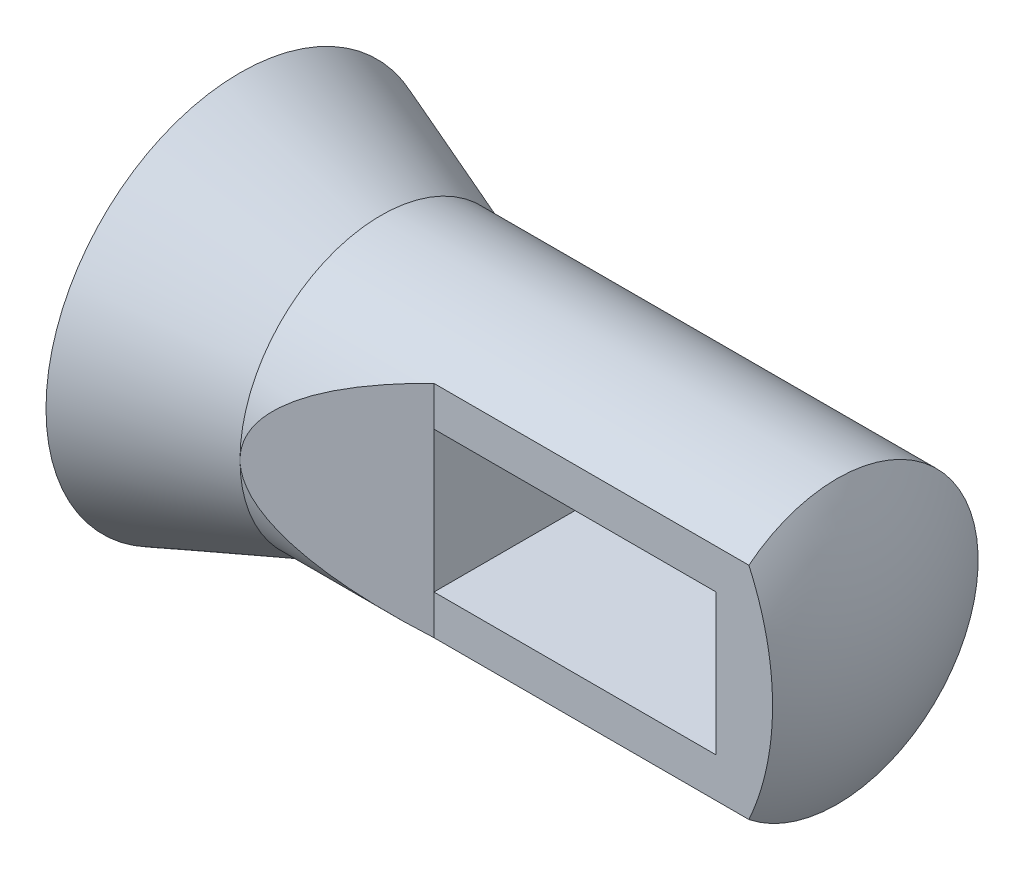
ISO-10303-21;
HEADER;
FILE_DESCRIPTION(('STEP AP214'),'2;1');
FILE_NAME('part.step','',(''),(''),'','','');
FILE_SCHEMA(('AUTOMOTIVE_DESIGN { 1 0 10303 214 1 1 1 1 }'));
ENDSEC;
DATA;
#1=APPLICATION_CONTEXT('core data for automotive mechanical design processes');
#2=APPLICATION_PROTOCOL_DEFINITION('international standard','automotive_design',2000,#1);
#3=PRODUCT_CONTEXT('',#1,'mechanical');
#4=PRODUCT('Part','Part','',(#3));
#5=PRODUCT_RELATED_PRODUCT_CATEGORY('part','',(#4));
#6=PRODUCT_DEFINITION_FORMATION('','',#4);
#7=PRODUCT_DEFINITION_CONTEXT('part definition',#1,'design');
#8=PRODUCT_DEFINITION('design','',#6,#7);
#9=PRODUCT_DEFINITION_SHAPE('','',#8);
#10=(LENGTH_UNIT() NAMED_UNIT(*) SI_UNIT(.MILLI.,.METRE.));
#11=(NAMED_UNIT(*) PLANE_ANGLE_UNIT() SI_UNIT($,.RADIAN.));
#12=(NAMED_UNIT(*) SI_UNIT($,.STERADIAN.) SOLID_ANGLE_UNIT());
#13=UNCERTAINTY_MEASURE_WITH_UNIT(LENGTH_MEASURE(1.E-05),#10,'distance_accuracy_value','');
#14=(GEOMETRIC_REPRESENTATION_CONTEXT(3) GLOBAL_UNCERTAINTY_ASSIGNED_CONTEXT((#13)) GLOBAL_UNIT_ASSIGNED_CONTEXT((#10,
#11,#12)) REPRESENTATION_CONTEXT('',''));
#15=CARTESIAN_POINT('',(0.,0.,0.));
#16=DIRECTION('',(0.,0.,1.));
#17=DIRECTION('',(1.,0.,0.));
#18=AXIS2_PLACEMENT_3D('',#15,#16,#17);
#19=CARTESIAN_POINT('',(0.,0.,0.));
#20=DIRECTION('',(1.,0.,0.));
#21=DIRECTION('',(0.,1.,0.));
#22=AXIS2_PLACEMENT_3D('',#19,#20,#21);
#23=PLANE('',#22);
#24=CARTESIAN_POINT('',(0.,0.,0.));
#25=DIRECTION('',(-1.,0.,0.));
#26=DIRECTION('',(0.,-1.,0.));
#27=AXIS2_PLACEMENT_3D('',#24,#25,#26);
#28=CIRCLE('',#27,34.925);
#29=CARTESIAN_POINT('',(0.,-34.925,0.));
#30=VERTEX_POINT('',#29);
#31=EDGE_CURVE('E142',#30,#30,#28,.T.);
#32=ORIENTED_EDGE('',*,*,#31,.T.);
#33=EDGE_LOOP('',(#32));
#34=FACE_BOUND('',#33,.T.);
#35=ADVANCED_FACE('F33',(#34),#23,.F.);
#36=CARTESIAN_POINT('',(25.4,0.,0.));
#37=DIRECTION('',(-1.,0.,0.));
#38=DIRECTION('',(0.,-1.,0.));
#39=AXIS2_PLACEMENT_3D('',#36,#37,#38);
#40=CONICAL_SURFACE('',#39,25.4,0.358770670270572);
#41=ORIENTED_EDGE('',*,*,#31,.F.);
#42=EDGE_LOOP('',(#41));
#43=FACE_BOUND('',#42,.T.);
#44=CARTESIAN_POINT('',(25.4,0.,0.));
#45=DIRECTION('',(-1.,0.,0.));
#46=DIRECTION('',(0.,-1.,0.));
#47=AXIS2_PLACEMENT_3D('',#44,#45,#46);
#48=CIRCLE('',#47,25.4);
#49=CARTESIAN_POINT('',(25.4,0.,25.4));
#50=VERTEX_POINT('',#49);
#51=EDGE_CURVE('E139',#50,#50,#48,.T.);
#52=ORIENTED_EDGE('',*,*,#51,.T.);
#53=EDGE_LOOP('',(#52));
#54=FACE_BOUND('',#53,.T.);
#55=ADVANCED_FACE('F156',(#43,#54),#40,.T.);
#56=CARTESIAN_POINT('',(0.,0.,0.));
#57=DIRECTION('',(-1.,0.,0.));
#58=DIRECTION('',(0.,-1.,0.));
#59=AXIS2_PLACEMENT_3D('',#56,#57,#58);
#60=CYLINDRICAL_SURFACE('',#59,25.4);
#61=DIRECTION('',(-1.,0.,0.));
#62=VECTOR('',#61,1.);
#63=CARTESIAN_POINT('',(0.,12.7,-21.9970452561248));
#64=LINE('',#63,#62);
#65=CARTESIAN_POINT('',(101.6,12.7,-21.9970452561247));
#66=VERTEX_POINT('',#65);
#67=CARTESIAN_POINT('',(50.8,12.7,-21.9970452561248));
#68=VERTEX_POINT('',#67);
#69=EDGE_CURVE('E121',#66,#68,#64,.T.);
#70=ORIENTED_EDGE('',*,*,#69,.T.);
#71=CARTESIAN_POINT('',(50.8,0.,0.));
#72=DIRECTION('',(-1.,0.,0.));
#73=DIRECTION('',(0.,0.,1.));
#74=AXIS2_PLACEMENT_3D('',#71,#72,#73);
#75=CIRCLE('',#74,25.4);
#76=CARTESIAN_POINT('',(50.8,-12.7,-21.9970452561247));
#77=VERTEX_POINT('',#76);
#78=EDGE_CURVE('E124',#68,#77,#75,.T.);
#79=ORIENTED_EDGE('',*,*,#78,.T.);
#80=DIRECTION('',(-1.,0.,0.));
#81=VECTOR('',#80,1.);
#82=CARTESIAN_POINT('',(0.,-12.7,-21.9970452561247));
#83=LINE('',#82,#81);
#84=CARTESIAN_POINT('',(101.6,-12.7,-21.9970452561247));
#85=VERTEX_POINT('',#84);
#86=EDGE_CURVE('E116',#77,#85,#83,.F.);
#87=ORIENTED_EDGE('',*,*,#86,.T.);
#88=CARTESIAN_POINT('',(101.6,0.,0.));
#89=DIRECTION('',(1.,0.,0.));
#90=DIRECTION('',(0.,0.,-1.));
#91=AXIS2_PLACEMENT_3D('',#88,#89,#90);
#92=CIRCLE('',#91,25.4);
#93=EDGE_CURVE('E94',#85,#66,#92,.T.);
#94=ORIENTED_EDGE('',*,*,#93,.T.);
#95=EDGE_LOOP('',(#70,#79,#87,#94));
#96=FACE_BOUND('',#95,.T.);
#97=DIRECTION('',(-1.,0.,0.));
#98=VECTOR('',#97,1.);
#99=CARTESIAN_POINT('',(0.,-19.8278686449149,15.875));
#100=LINE('',#99,#98);
#101=CARTESIAN_POINT('',(107.494090512249,-19.8278686449149,15.875));
#102=VERTEX_POINT('',#101);
#103=CARTESIAN_POINT('',(50.8,-19.8278686449149,15.875));
#104=VERTEX_POINT('',#103);
#105=EDGE_CURVE('E133',#102,#104,#100,.T.);
#106=ORIENTED_EDGE('',*,*,#105,.T.);
#107=CARTESIAN_POINT('',(93.1333333333333,0.,0.));
#108=DIRECTION('',(-0.351123441588392,0.,-0.936329177569045));
#109=DIRECTION('',(-0.936329177569045,0.,0.351123441588392));
#110=AXIS2_PLACEMENT_3D('',#107,#108,#109);
#111=ELLIPSE('',#110,72.3392317103551,25.4);
#112=EDGE_CURVE('E11',#104,#50,#111,.T.);
#113=ORIENTED_EDGE('',*,*,#112,.T.);
#114=ORIENTED_EDGE('',*,*,#51,.F.);
#115=CARTESIAN_POINT('',(50.8,19.8278686449149,15.875));
#116=VERTEX_POINT('',#115);
#117=EDGE_CURVE('E36',#50,#116,#111,.T.);
#118=ORIENTED_EDGE('',*,*,#117,.T.);
#119=DIRECTION('',(-1.,0.,0.));
#120=VECTOR('',#119,1.);
#121=CARTESIAN_POINT('',(0.,19.8278686449149,15.875));
#122=LINE('',#121,#120);
#123=CARTESIAN_POINT('',(107.494090512249,19.8278686449149,15.875));
#124=VERTEX_POINT('',#123);
#125=EDGE_CURVE('E130',#116,#124,#122,.F.);
#126=ORIENTED_EDGE('',*,*,#125,.T.);
#127=CARTESIAN_POINT('',(107.494090512249,0.,0.));
#128=DIRECTION('',(-1.,0.,0.));
#129=DIRECTION('',(0.,-1.,0.));
#130=AXIS2_PLACEMENT_3D('',#127,#128,#129);
#131=CIRCLE('',#130,25.4);
#132=EDGE_CURVE('E136',#124,#102,#131,.T.);
#133=ORIENTED_EDGE('',*,*,#132,.T.);
#134=EDGE_LOOP('',(#106,#113,#114,#118,#126,#133));
#135=FACE_BOUND('',#134,.T.);
#136=ADVANCED_FACE('F151',(#96,#135),#60,.T.);
#137=CARTESIAN_POINT('',(63.5,0.,0.));
#138=DIRECTION('',(-1.,0.,0.));
#139=DIRECTION('',(0.,1.,0.));
#140=AXIS2_PLACEMENT_3D('',#137,#138,#139);
#141=SPHERICAL_SURFACE('',#140,50.8);
#142=ORIENTED_EDGE('',*,*,#132,.F.);
#143=CARTESIAN_POINT('',(63.5,0.,15.875));
#144=DIRECTION('',(0.,0.,-1.));
#145=DIRECTION('',(-1.,0.,0.));
#146=AXIS2_PLACEMENT_3D('',#143,#144,#145);
#147=CIRCLE('',#146,48.2558221875869);
#148=EDGE_CURVE('E144',#124,#102,#147,.T.);
#149=ORIENTED_EDGE('',*,*,#148,.T.);
#150=EDGE_LOOP('',(#142,#149));
#151=FACE_BOUND('',#150,.T.);
#152=ADVANCED_FACE('F163',(#151),#141,.T.);
#153=CARTESIAN_POINT('',(25.4,-34.925,25.4));
#154=DIRECTION('',(-0.351123441588392,0.,-0.936329177569045));
#155=DIRECTION('',(-0.936329177569045,0.,0.351123441588392));
#156=AXIS2_PLACEMENT_3D('',#153,#154,#155);
#157=PLANE('',#156);
#158=ORIENTED_EDGE('',*,*,#112,.F.);
#159=DIRECTION('',(0.,1.,0.));
#160=VECTOR('',#159,1.);
#161=CARTESIAN_POINT('',(50.8,-34.925,15.875));
#162=LINE('',#161,#160);
#163=CARTESIAN_POINT('',(50.8,-12.7,15.875));
#164=VERTEX_POINT('',#163);
#165=EDGE_CURVE('E128',#104,#164,#162,.T.);
#166=ORIENTED_EDGE('',*,*,#165,.T.);
#167=DIRECTION('',(0.,-1.,0.));
#168=VECTOR('',#167,1.);
#169=CARTESIAN_POINT('',(50.8,12.7,15.875));
#170=LINE('',#169,#168);
#171=CARTESIAN_POINT('',(50.8,12.7,15.875));
#172=VERTEX_POINT('',#171);
#173=EDGE_CURVE('E55',#172,#164,#170,.T.);
#174=ORIENTED_EDGE('',*,*,#173,.F.);
#175=EDGE_CURVE('E127',#172,#116,#162,.T.);
#176=ORIENTED_EDGE('',*,*,#175,.T.);
#177=ORIENTED_EDGE('',*,*,#117,.F.);
#178=EDGE_LOOP('',(#158,#166,#174,#176,#177));
#179=FACE_BOUND('',#178,.T.);
#180=ADVANCED_FACE('F154',(#179),#157,.F.);
#181=CARTESIAN_POINT('',(50.8,-34.925,15.875));
#182=DIRECTION('',(0.,0.,-1.));
#183=DIRECTION('',(-1.,0.,0.));
#184=AXIS2_PLACEMENT_3D('',#181,#182,#183);
#185=PLANE('',#184);
#186=ORIENTED_EDGE('',*,*,#175,.F.);
#187=DIRECTION('',(-1.,0.,0.));
#188=VECTOR('',#187,1.);
#189=CARTESIAN_POINT('',(50.8,12.7,15.875));
#190=LINE('',#189,#188);
#191=CARTESIAN_POINT('',(101.6,12.7,15.875));
#192=VERTEX_POINT('',#191);
#193=EDGE_CURVE('E109',#192,#172,#190,.T.);
#194=ORIENTED_EDGE('',*,*,#193,.F.);
#195=DIRECTION('',(0.,1.,0.));
#196=VECTOR('',#195,1.);
#197=CARTESIAN_POINT('',(101.6,-12.7,15.875));
#198=LINE('',#197,#196);
#199=CARTESIAN_POINT('',(101.6,-12.7,15.875));
#200=VERTEX_POINT('',#199);
#201=EDGE_CURVE('E91',#200,#192,#198,.T.);
#202=ORIENTED_EDGE('',*,*,#201,.F.);
#203=DIRECTION('',(1.,0.,0.));
#204=VECTOR('',#203,1.);
#205=CARTESIAN_POINT('',(50.8,-12.7,15.875));
#206=LINE('',#205,#204);
#207=EDGE_CURVE('E100',#164,#200,#206,.T.);
#208=ORIENTED_EDGE('',*,*,#207,.F.);
#209=ORIENTED_EDGE('',*,*,#165,.F.);
#210=ORIENTED_EDGE('',*,*,#105,.F.);
#211=ORIENTED_EDGE('',*,*,#148,.F.);
#212=ORIENTED_EDGE('',*,*,#125,.F.);
#213=EDGE_LOOP('',(#186,#194,#202,#208,#209,#210,#211,#212));
#214=FACE_BOUND('',#213,.T.);
#215=ADVANCED_FACE('F107',(#214),#185,.F.);
#216=CARTESIAN_POINT('',(50.8,12.7,-34.925));
#217=DIRECTION('',(-1.,0.,0.));
#218=DIRECTION('',(0.,0.,1.));
#219=AXIS2_PLACEMENT_3D('',#216,#217,#218);
#220=PLANE('',#219);
#221=DIRECTION('',(0.,0.,1.));
#222=VECTOR('',#221,1.);
#223=CARTESIAN_POINT('',(50.8,12.7,-34.925));
#224=LINE('',#223,#222);
#225=EDGE_CURVE('E114',#68,#172,#224,.T.);
#226=ORIENTED_EDGE('',*,*,#225,.T.);
#227=ORIENTED_EDGE('',*,*,#173,.T.);
#228=DIRECTION('',(0.,0.,1.));
#229=VECTOR('',#228,1.);
#230=CARTESIAN_POINT('',(50.8,-12.7,-34.925));
#231=LINE('',#230,#229);
#232=EDGE_CURVE('E97',#77,#164,#231,.T.);
#233=ORIENTED_EDGE('',*,*,#232,.F.);
#234=ORIENTED_EDGE('',*,*,#78,.F.);
#235=EDGE_LOOP('',(#226,#227,#233,#234));
#236=FACE_BOUND('',#235,.T.);
#237=ADVANCED_FACE('F173',(#236),#220,.F.);
#238=CARTESIAN_POINT('',(50.8,12.7,-34.925));
#239=DIRECTION('',(0.,1.,0.));
#240=DIRECTION('',(-1.,0.,0.));
#241=AXIS2_PLACEMENT_3D('',#238,#239,#240);
#242=PLANE('',#241);
#243=DIRECTION('',(0.,0.,1.));
#244=VECTOR('',#243,1.);
#245=CARTESIAN_POINT('',(101.6,12.7,-34.925));
#246=LINE('',#245,#244);
#247=EDGE_CURVE('E96',#66,#192,#246,.T.);
#248=ORIENTED_EDGE('',*,*,#247,.T.);
#249=ORIENTED_EDGE('',*,*,#193,.T.);
#250=ORIENTED_EDGE('',*,*,#225,.F.);
#251=ORIENTED_EDGE('',*,*,#69,.F.);
#252=EDGE_LOOP('',(#248,#249,#250,#251));
#253=FACE_BOUND('',#252,.T.);
#254=ADVANCED_FACE('F178',(#253),#242,.F.);
#255=CARTESIAN_POINT('',(101.6,-12.7,-34.925));
#256=DIRECTION('',(1.,0.,0.));
#257=DIRECTION('',(0.,0.,-1.));
#258=AXIS2_PLACEMENT_3D('',#255,#256,#257);
#259=PLANE('',#258);
#260=DIRECTION('',(0.,0.,1.));
#261=VECTOR('',#260,1.);
#262=CARTESIAN_POINT('',(101.6,-12.7,-34.925));
#263=LINE('',#262,#261);
#264=EDGE_CURVE('E47',#85,#200,#263,.T.);
#265=ORIENTED_EDGE('',*,*,#264,.T.);
#266=ORIENTED_EDGE('',*,*,#201,.T.);
#267=ORIENTED_EDGE('',*,*,#247,.F.);
#268=ORIENTED_EDGE('',*,*,#93,.F.);
#269=EDGE_LOOP('',(#265,#266,#267,#268));
#270=FACE_BOUND('',#269,.T.);
#271=ADVANCED_FACE('F88',(#270),#259,.F.);
#272=CARTESIAN_POINT('',(50.8,-12.7,-34.925));
#273=DIRECTION('',(0.,-1.,0.));
#274=DIRECTION('',(0.,0.,-1.));
#275=AXIS2_PLACEMENT_3D('',#272,#273,#274);
#276=PLANE('',#275);
#277=ORIENTED_EDGE('',*,*,#232,.T.);
#278=ORIENTED_EDGE('',*,*,#207,.T.);
#279=ORIENTED_EDGE('',*,*,#264,.F.);
#280=ORIENTED_EDGE('',*,*,#86,.F.);
#281=EDGE_LOOP('',(#277,#278,#279,#280));
#282=FACE_BOUND('',#281,.T.);
#283=ADVANCED_FACE('F101',(#282),#276,.F.);
#284=CLOSED_SHELL('',(#35,#55,#136,#152,#180,#215,#237,#254,#271,#283));
#285=MANIFOLD_SOLID_BREP('B2',#284);
#286=ADVANCED_BREP_SHAPE_REPRESENTATION('',(#18,#285),#14);
#287=SHAPE_DEFINITION_REPRESENTATION(#9,#286);
ENDSEC;
END-ISO-10303-21;
